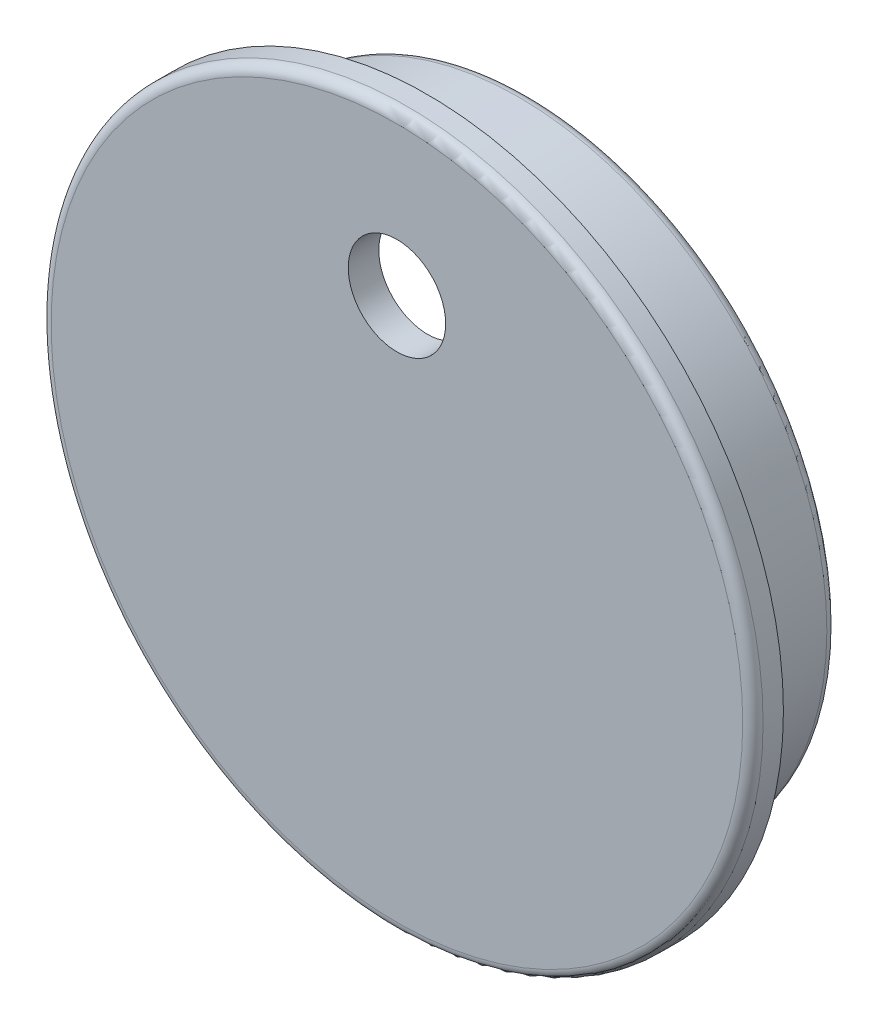
ISO-10303-21;
HEADER;
FILE_DESCRIPTION(('STEP AP214'),'2;1');
FILE_NAME('part.step','',(''),(''),'','','');
FILE_SCHEMA(('AUTOMOTIVE_DESIGN { 1 0 10303 214 1 1 1 1 }'));
ENDSEC;
DATA;
#1=APPLICATION_CONTEXT('core data for automotive mechanical design processes');
#2=APPLICATION_PROTOCOL_DEFINITION('international standard','automotive_design',2000,#1);
#3=PRODUCT_CONTEXT('',#1,'mechanical');
#4=PRODUCT('Part','Part','',(#3));
#5=PRODUCT_RELATED_PRODUCT_CATEGORY('part','',(#4));
#6=PRODUCT_DEFINITION_FORMATION('','',#4);
#7=PRODUCT_DEFINITION_CONTEXT('part definition',#1,'design');
#8=PRODUCT_DEFINITION('design','',#6,#7);
#9=PRODUCT_DEFINITION_SHAPE('','',#8);
#10=(LENGTH_UNIT() NAMED_UNIT(*) SI_UNIT(.MILLI.,.METRE.));
#11=(NAMED_UNIT(*) PLANE_ANGLE_UNIT() SI_UNIT($,.RADIAN.));
#12=(NAMED_UNIT(*) SI_UNIT($,.STERADIAN.) SOLID_ANGLE_UNIT());
#13=UNCERTAINTY_MEASURE_WITH_UNIT(LENGTH_MEASURE(1.E-05),#10,'distance_accuracy_value','');
#14=(GEOMETRIC_REPRESENTATION_CONTEXT(3) GLOBAL_UNCERTAINTY_ASSIGNED_CONTEXT((#13)) GLOBAL_UNIT_ASSIGNED_CONTEXT((#10,
#11,#12)) REPRESENTATION_CONTEXT('',''));
#15=CARTESIAN_POINT('',(0.,0.,0.));
#16=DIRECTION('',(0.,0.,1.));
#17=DIRECTION('',(1.,0.,0.));
#18=AXIS2_PLACEMENT_3D('',#15,#16,#17);
#19=CARTESIAN_POINT('',(0.,0.,3.81));
#20=DIRECTION('',(0.,0.,-1.));
#21=DIRECTION('',(-1.,0.,0.));
#22=AXIS2_PLACEMENT_3D('',#19,#20,#21);
#23=CYLINDRICAL_SURFACE('',#22,44.45);
#24=CARTESIAN_POINT('',(0.,0.,2.54));
#25=DIRECTION('',(0.,0.,1.));
#26=DIRECTION('',(1.,0.,0.));
#27=AXIS2_PLACEMENT_3D('',#24,#25,#26);
#28=CIRCLE('',#27,44.45);
#29=CARTESIAN_POINT('',(44.45,0.,2.54));
#30=VERTEX_POINT('',#29);
#31=EDGE_CURVE('E10',#30,#30,#28,.F.);
#32=ORIENTED_EDGE('',*,*,#31,.T.);
#33=EDGE_LOOP('',(#32));
#34=FACE_BOUND('',#33,.T.);
#35=CARTESIAN_POINT('',(0.,0.,0.));
#36=DIRECTION('',(0.,0.,1.));
#37=DIRECTION('',(1.,0.,0.));
#38=AXIS2_PLACEMENT_3D('',#35,#36,#37);
#39=CIRCLE('',#38,44.45);
#40=CARTESIAN_POINT('',(44.45,0.,0.));
#41=VERTEX_POINT('',#40);
#42=EDGE_CURVE('E66',#41,#41,#39,.T.);
#43=ORIENTED_EDGE('',*,*,#42,.T.);
#44=EDGE_LOOP('',(#43));
#45=FACE_BOUND('',#44,.T.);
#46=ADVANCED_FACE('F31',(#34,#45),#23,.T.);
#47=CARTESIAN_POINT('',(0.,0.,3.81));
#48=DIRECTION('',(0.,0.,1.));
#49=DIRECTION('',(1.,0.,0.));
#50=AXIS2_PLACEMENT_3D('',#47,#48,#49);
#51=PLANE('',#50);
#52=CARTESIAN_POINT('',(0.,24.5999,3.81));
#53=DIRECTION('',(0.,0.,1.));
#54=DIRECTION('',(1.,0.,0.));
#55=AXIS2_PLACEMENT_3D('',#52,#53,#54);
#56=CIRCLE('',#55,6.0833);
#57=CARTESIAN_POINT('',(6.08329999999999,24.5999,3.81));
#58=VERTEX_POINT('',#57);
#59=EDGE_CURVE('E69',#58,#58,#56,.T.);
#60=ORIENTED_EDGE('',*,*,#59,.F.);
#61=EDGE_LOOP('',(#60));
#62=FACE_BOUND('',#61,.T.);
#63=CARTESIAN_POINT('',(0.,0.,3.81));
#64=DIRECTION('',(0.,0.,1.));
#65=DIRECTION('',(1.,0.,0.));
#66=AXIS2_PLACEMENT_3D('',#63,#64,#65);
#67=CIRCLE('',#66,43.18);
#68=CARTESIAN_POINT('',(43.18,0.,3.81));
#69=VERTEX_POINT('',#68);
#70=EDGE_CURVE('E39',#69,#69,#67,.T.);
#71=ORIENTED_EDGE('',*,*,#70,.T.);
#72=EDGE_LOOP('',(#71));
#73=FACE_BOUND('',#72,.T.);
#74=ADVANCED_FACE('F89',(#62,#73),#51,.T.);
#75=CARTESIAN_POINT('',(0.,0.,0.));
#76=DIRECTION('',(0.,0.,1.));
#77=DIRECTION('',(1.,0.,0.));
#78=AXIS2_PLACEMENT_3D('',#75,#76,#77);
#79=PLANE('',#78);
#80=CARTESIAN_POINT('',(0.,0.,0.));
#81=DIRECTION('',(0.,0.,1.));
#82=DIRECTION('',(1.,0.,0.));
#83=AXIS2_PLACEMENT_3D('',#80,#81,#82);
#84=CIRCLE('',#83,38.4429);
#85=CARTESIAN_POINT('',(38.4429,0.,0.));
#86=VERTEX_POINT('',#85);
#87=EDGE_CURVE('E63',#86,#86,#84,.F.);
#88=ORIENTED_EDGE('',*,*,#87,.F.);
#89=EDGE_LOOP('',(#88));
#90=FACE_BOUND('',#89,.T.);
#91=ORIENTED_EDGE('',*,*,#42,.F.);
#92=EDGE_LOOP('',(#91));
#93=FACE_BOUND('',#92,.T.);
#94=ADVANCED_FACE('F94',(#90,#93),#79,.F.);
#95=CARTESIAN_POINT('',(0.,0.,-12.7));
#96=DIRECTION('',(0.,0.,-1.));
#97=DIRECTION('',(-1.,0.,0.));
#98=AXIS2_PLACEMENT_3D('',#95,#96,#97);
#99=PLANE('',#98);
#100=CARTESIAN_POINT('',(0.,0.,-12.7));
#101=DIRECTION('',(0.,0.,-1.));
#102=DIRECTION('',(-1.,0.,0.));
#103=AXIS2_PLACEMENT_3D('',#100,#101,#102);
#104=CIRCLE('',#103,35.9029);
#105=CARTESIAN_POINT('',(-35.9029,0.,-12.7));
#106=VERTEX_POINT('',#105);
#107=EDGE_CURVE('E48',#106,#106,#104,.F.);
#108=ORIENTED_EDGE('',*,*,#107,.T.);
#109=EDGE_LOOP('',(#108));
#110=FACE_BOUND('',#109,.T.);
#111=CARTESIAN_POINT('',(0.,0.,-12.7));
#112=DIRECTION('',(0.,0.,-1.));
#113=DIRECTION('',(-1.,0.,0.));
#114=AXIS2_PLACEMENT_3D('',#111,#112,#113);
#115=CIRCLE('',#114,37.1729);
#116=CARTESIAN_POINT('',(-37.1729,0.,-12.7));
#117=VERTEX_POINT('',#116);
#118=EDGE_CURVE('E51',#117,#117,#115,.T.);
#119=ORIENTED_EDGE('',*,*,#118,.T.);
#120=EDGE_LOOP('',(#119));
#121=FACE_BOUND('',#120,.T.);
#122=ADVANCED_FACE('F115',(#110,#121),#99,.T.);
#123=CARTESIAN_POINT('',(0.,0.,-12.7));
#124=DIRECTION('',(0.,0.,1.));
#125=DIRECTION('',(1.,0.,0.));
#126=AXIS2_PLACEMENT_3D('',#123,#124,#125);
#127=CYLINDRICAL_SURFACE('',#126,38.4429);
#128=CARTESIAN_POINT('',(0.,0.,-11.43));
#129=DIRECTION('',(0.,0.,-1.));
#130=DIRECTION('',(-1.,0.,0.));
#131=AXIS2_PLACEMENT_3D('',#128,#129,#130);
#132=CIRCLE('',#131,38.4429);
#133=CARTESIAN_POINT('',(-38.4429,0.,-11.43));
#134=VERTEX_POINT('',#133);
#135=EDGE_CURVE('E43',#134,#134,#132,.F.);
#136=ORIENTED_EDGE('',*,*,#135,.T.);
#137=EDGE_LOOP('',(#136));
#138=FACE_BOUND('',#137,.T.);
#139=ORIENTED_EDGE('',*,*,#87,.T.);
#140=EDGE_LOOP('',(#139));
#141=FACE_BOUND('',#140,.T.);
#142=ADVANCED_FACE('F117',(#138,#141),#127,.T.);
#143=CARTESIAN_POINT('',(0.,0.,-12.7));
#144=DIRECTION('',(0.,0.,1.));
#145=DIRECTION('',(1.,0.,0.));
#146=AXIS2_PLACEMENT_3D('',#143,#144,#145);
#147=CYLINDRICAL_SURFACE('',#146,34.6329);
#148=CARTESIAN_POINT('',(0.,0.,-1.27));
#149=DIRECTION('',(0.,0.,1.));
#150=DIRECTION('',(1.,0.,0.));
#151=AXIS2_PLACEMENT_3D('',#148,#149,#150);
#152=CIRCLE('',#151,34.6329);
#153=CARTESIAN_POINT('',(34.6329,0.,-1.27));
#154=VERTEX_POINT('',#153);
#155=EDGE_CURVE('E54',#154,#154,#152,.T.);
#156=ORIENTED_EDGE('',*,*,#155,.T.);
#157=EDGE_LOOP('',(#156));
#158=FACE_BOUND('',#157,.T.);
#159=CARTESIAN_POINT('',(0.,0.,-11.43));
#160=DIRECTION('',(0.,0.,-1.));
#161=DIRECTION('',(-1.,0.,0.));
#162=AXIS2_PLACEMENT_3D('',#159,#160,#161);
#163=CIRCLE('',#162,34.6329);
#164=CARTESIAN_POINT('',(-34.6329,0.,-11.43));
#165=VERTEX_POINT('',#164);
#166=EDGE_CURVE('E57',#165,#165,#163,.T.);
#167=ORIENTED_EDGE('',*,*,#166,.T.);
#168=EDGE_LOOP('',(#167));
#169=FACE_BOUND('',#168,.T.);
#170=ADVANCED_FACE('F124',(#158,#169),#147,.F.);
#171=CARTESIAN_POINT('',(0.,24.5999,0.));
#172=DIRECTION('',(0.,0.,1.));
#173=DIRECTION('',(1.,0.,0.));
#174=AXIS2_PLACEMENT_3D('',#171,#172,#173);
#175=CIRCLE('',#174,6.0833);
#176=CARTESIAN_POINT('',(6.08329999999999,24.5999,0.));
#177=VERTEX_POINT('',#176);
#178=EDGE_CURVE('E35',#177,#177,#175,.T.);
#179=ORIENTED_EDGE('',*,*,#178,.T.);
#180=EDGE_LOOP('',(#179));
#181=FACE_BOUND('',#180,.T.);
#182=CARTESIAN_POINT('',(0.,0.,0.));
#183=DIRECTION('',(0.,0.,1.));
#184=DIRECTION('',(1.,0.,0.));
#185=AXIS2_PLACEMENT_3D('',#182,#183,#184);
#186=CIRCLE('',#185,33.3629);
#187=CARTESIAN_POINT('',(33.3629,0.,0.));
#188=VERTEX_POINT('',#187);
#189=EDGE_CURVE('E60',#188,#188,#186,.F.);
#190=ORIENTED_EDGE('',*,*,#189,.T.);
#191=EDGE_LOOP('',(#190));
#192=FACE_BOUND('',#191,.T.);
#193=ADVANCED_FACE('F76',(#181,#192),#79,.F.);
#194=CARTESIAN_POINT('',(0.,0.,-1.27));
#195=DIRECTION('',(0.,0.,1.));
#196=DIRECTION('',(1.,0.,0.));
#197=AXIS2_PLACEMENT_3D('',#194,#195,#196);
#198=TOROIDAL_SURFACE('',#197,33.3629,1.27);
#199=ORIENTED_EDGE('',*,*,#155,.F.);
#200=EDGE_LOOP('',(#199));
#201=FACE_BOUND('',#200,.T.);
#202=ORIENTED_EDGE('',*,*,#189,.F.);
#203=EDGE_LOOP('',(#202));
#204=FACE_BOUND('',#203,.T.);
#205=ADVANCED_FACE('F100',(#201,#204),#198,.F.);
#206=CARTESIAN_POINT('',(0.,0.,-11.43));
#207=DIRECTION('',(0.,0.,-1.));
#208=DIRECTION('',(-1.,0.,0.));
#209=AXIS2_PLACEMENT_3D('',#206,#207,#208);
#210=TOROIDAL_SURFACE('',#209,35.9029,1.27);
#211=ORIENTED_EDGE('',*,*,#107,.F.);
#212=EDGE_LOOP('',(#211));
#213=FACE_BOUND('',#212,.T.);
#214=ORIENTED_EDGE('',*,*,#166,.F.);
#215=EDGE_LOOP('',(#214));
#216=FACE_BOUND('',#215,.T.);
#217=ADVANCED_FACE('F103',(#213,#216),#210,.T.);
#218=CARTESIAN_POINT('',(0.,0.,-11.43));
#219=DIRECTION('',(0.,0.,-1.));
#220=DIRECTION('',(-1.,0.,0.));
#221=AXIS2_PLACEMENT_3D('',#218,#219,#220);
#222=TOROIDAL_SURFACE('',#221,37.1729,1.27);
#223=ORIENTED_EDGE('',*,*,#135,.F.);
#224=EDGE_LOOP('',(#223));
#225=FACE_BOUND('',#224,.T.);
#226=ORIENTED_EDGE('',*,*,#118,.F.);
#227=EDGE_LOOP('',(#226));
#228=FACE_BOUND('',#227,.T.);
#229=ADVANCED_FACE('F85',(#225,#228),#222,.T.);
#230=CARTESIAN_POINT('',(0.,0.,2.54));
#231=DIRECTION('',(0.,0.,1.));
#232=DIRECTION('',(1.,0.,0.));
#233=AXIS2_PLACEMENT_3D('',#230,#231,#232);
#234=TOROIDAL_SURFACE('',#233,43.18,1.27);
#235=ORIENTED_EDGE('',*,*,#31,.F.);
#236=EDGE_LOOP('',(#235));
#237=FACE_BOUND('',#236,.T.);
#238=ORIENTED_EDGE('',*,*,#70,.F.);
#239=EDGE_LOOP('',(#238));
#240=FACE_BOUND('',#239,.T.);
#241=ADVANCED_FACE('F33',(#237,#240),#234,.T.);
#242=CARTESIAN_POINT('',(0.,24.5999,-12.7));
#243=DIRECTION('',(0.,0.,1.));
#244=DIRECTION('',(1.,0.,0.));
#245=AXIS2_PLACEMENT_3D('',#242,#243,#244);
#246=CYLINDRICAL_SURFACE('',#245,6.0833);
#247=ORIENTED_EDGE('',*,*,#59,.T.);
#248=EDGE_LOOP('',(#247));
#249=FACE_BOUND('',#248,.T.);
#250=ORIENTED_EDGE('',*,*,#178,.F.);
#251=EDGE_LOOP('',(#250));
#252=FACE_BOUND('',#251,.T.);
#253=ADVANCED_FACE('F79',(#249,#252),#246,.F.);
#254=CLOSED_SHELL('',(#46,#74,#94,#122,#142,#170,#193,#205,#217,#229,#241,#253));
#255=MANIFOLD_SOLID_BREP('B2',#254);
#256=ADVANCED_BREP_SHAPE_REPRESENTATION('',(#18,#255),#14);
#257=SHAPE_DEFINITION_REPRESENTATION(#9,#256);
ENDSEC;
END-ISO-10303-21;
